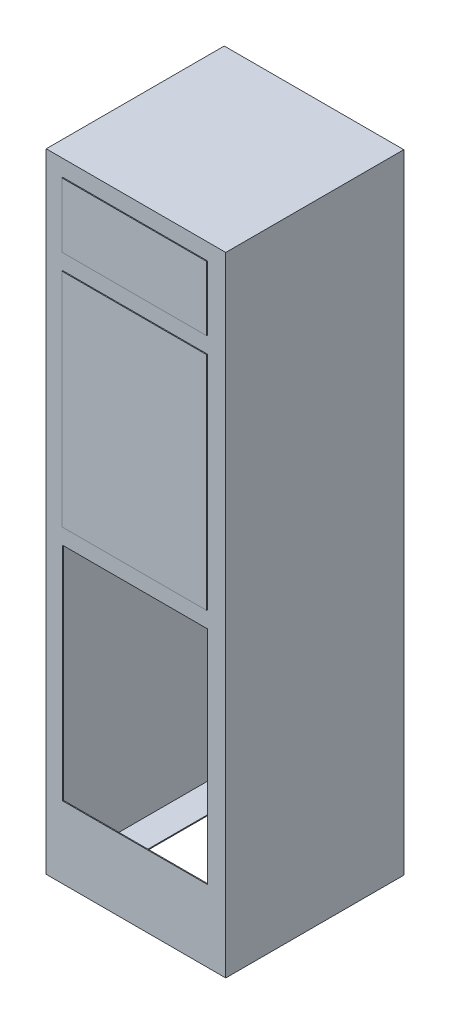
ISO-10303-21;
HEADER;
FILE_DESCRIPTION(('STEP AP214'),'2;1');
FILE_NAME('part.step','',(''),(''),'','','');
FILE_SCHEMA(('AUTOMOTIVE_DESIGN { 1 0 10303 214 1 1 1 1 }'));
ENDSEC;
DATA;
#1=APPLICATION_CONTEXT('core data for automotive mechanical design processes');
#2=APPLICATION_PROTOCOL_DEFINITION('international standard','automotive_design',2000,#1);
#3=PRODUCT_CONTEXT('',#1,'mechanical');
#4=PRODUCT('Part','Part','',(#3));
#5=PRODUCT_RELATED_PRODUCT_CATEGORY('part','',(#4));
#6=PRODUCT_DEFINITION_FORMATION('','',#4);
#7=PRODUCT_DEFINITION_CONTEXT('part definition',#1,'design');
#8=PRODUCT_DEFINITION('design','',#6,#7);
#9=PRODUCT_DEFINITION_SHAPE('','',#8);
#10=(LENGTH_UNIT() NAMED_UNIT(*) SI_UNIT(.MILLI.,.METRE.));
#11=(NAMED_UNIT(*) PLANE_ANGLE_UNIT() SI_UNIT($,.RADIAN.));
#12=(NAMED_UNIT(*) SI_UNIT($,.STERADIAN.) SOLID_ANGLE_UNIT());
#13=UNCERTAINTY_MEASURE_WITH_UNIT(LENGTH_MEASURE(1.E-05),#10,'distance_accuracy_value','');
#14=(GEOMETRIC_REPRESENTATION_CONTEXT(3) GLOBAL_UNCERTAINTY_ASSIGNED_CONTEXT((#13)) GLOBAL_UNIT_ASSIGNED_CONTEXT((#10,
#11,#12)) REPRESENTATION_CONTEXT('',''));
#15=CARTESIAN_POINT('',(0.,0.,0.));
#16=DIRECTION('',(0.,0.,1.));
#17=DIRECTION('',(1.,0.,0.));
#18=AXIS2_PLACEMENT_3D('',#15,#16,#17);
#19=CARTESIAN_POINT('',(-245.,780.,598.));
#20=DIRECTION('',(1.,0.,0.));
#21=DIRECTION('',(0.,0.,-1.));
#22=AXIS2_PLACEMENT_3D('',#19,#20,#21);
#23=PLANE('',#22);
#24=DIRECTION('',(0.,-1.,0.));
#25=VECTOR('',#24,1.);
#26=CARTESIAN_POINT('',(-245.,780.,595.));
#27=LINE('',#26,#25);
#28=CARTESIAN_POINT('',(-245.,995.,595.));
#29=VERTEX_POINT('',#28);
#30=CARTESIAN_POINT('',(-245.,780.,595.));
#31=VERTEX_POINT('',#30);
#32=EDGE_CURVE('E108',#29,#31,#27,.T.);
#33=ORIENTED_EDGE('',*,*,#32,.T.);
#34=DIRECTION('',(0.,0.,-1.));
#35=VECTOR('',#34,1.);
#36=CARTESIAN_POINT('',(-245.,780.,598.));
#37=LINE('',#36,#35);
#38=CARTESIAN_POINT('',(-245.,780.,598.));
#39=VERTEX_POINT('',#38);
#40=EDGE_CURVE('E12',#39,#31,#37,.T.);
#41=ORIENTED_EDGE('',*,*,#40,.F.);
#42=DIRECTION('',(0.,-1.,0.));
#43=VECTOR('',#42,1.);
#44=CARTESIAN_POINT('',(-245.,780.,598.));
#45=LINE('',#44,#43);
#46=CARTESIAN_POINT('',(-245.,995.,598.));
#47=VERTEX_POINT('',#46);
#48=EDGE_CURVE('E96',#47,#39,#45,.T.);
#49=ORIENTED_EDGE('',*,*,#48,.F.);
#50=DIRECTION('',(0.,0.,-1.));
#51=VECTOR('',#50,1.);
#52=CARTESIAN_POINT('',(-245.,995.,598.));
#53=LINE('',#52,#51);
#54=EDGE_CURVE('E104',#47,#29,#53,.T.);
#55=ORIENTED_EDGE('',*,*,#54,.T.);
#56=EDGE_LOOP('',(#33,#41,#49,#55));
#57=FACE_BOUND('',#56,.T.);
#58=ADVANCED_FACE('F45',(#57),#23,.F.);
#59=CARTESIAN_POINT('',(239.,780.,598.));
#60=DIRECTION('',(0.,1.,0.));
#61=DIRECTION('',(0.,0.,1.));
#62=AXIS2_PLACEMENT_3D('',#59,#60,#61);
#63=PLANE('',#62);
#64=DIRECTION('',(1.,0.,0.));
#65=VECTOR('',#64,1.);
#66=CARTESIAN_POINT('',(239.,780.,595.));
#67=LINE('',#66,#65);
#68=CARTESIAN_POINT('',(239.,780.,595.));
#69=VERTEX_POINT('',#68);
#70=EDGE_CURVE('E100',#31,#69,#67,.T.);
#71=ORIENTED_EDGE('',*,*,#70,.T.);
#72=DIRECTION('',(0.,0.,-1.));
#73=VECTOR('',#72,1.);
#74=CARTESIAN_POINT('',(239.,780.,598.));
#75=LINE('',#74,#73);
#76=CARTESIAN_POINT('',(239.,780.,598.));
#77=VERTEX_POINT('',#76);
#78=EDGE_CURVE('E53',#77,#69,#75,.T.);
#79=ORIENTED_EDGE('',*,*,#78,.F.);
#80=DIRECTION('',(1.,0.,0.));
#81=VECTOR('',#80,1.);
#82=CARTESIAN_POINT('',(239.,780.,598.));
#83=LINE('',#82,#81);
#84=EDGE_CURVE('E91',#39,#77,#83,.T.);
#85=ORIENTED_EDGE('',*,*,#84,.F.);
#86=ORIENTED_EDGE('',*,*,#40,.T.);
#87=EDGE_LOOP('',(#71,#79,#85,#86));
#88=FACE_BOUND('',#87,.T.);
#89=ADVANCED_FACE('F99',(#88),#63,.F.);
#90=CARTESIAN_POINT('',(239.,995.,598.));
#91=DIRECTION('',(-1.,0.,0.));
#92=DIRECTION('',(0.,-1.,0.));
#93=AXIS2_PLACEMENT_3D('',#90,#91,#92);
#94=PLANE('',#93);
#95=DIRECTION('',(0.,1.,0.));
#96=VECTOR('',#95,1.);
#97=CARTESIAN_POINT('',(239.,995.,595.));
#98=LINE('',#97,#96);
#99=CARTESIAN_POINT('',(239.,995.,595.));
#100=VERTEX_POINT('',#99);
#101=EDGE_CURVE('E78',#69,#100,#98,.T.);
#102=ORIENTED_EDGE('',*,*,#101,.T.);
#103=DIRECTION('',(0.,0.,-1.));
#104=VECTOR('',#103,1.);
#105=CARTESIAN_POINT('',(239.,995.,598.));
#106=LINE('',#105,#104);
#107=CARTESIAN_POINT('',(239.,995.,598.));
#108=VERTEX_POINT('',#107);
#109=EDGE_CURVE('E101',#108,#100,#106,.T.);
#110=ORIENTED_EDGE('',*,*,#109,.F.);
#111=DIRECTION('',(0.,1.,0.));
#112=VECTOR('',#111,1.);
#113=CARTESIAN_POINT('',(239.,995.,598.));
#114=LINE('',#113,#112);
#115=EDGE_CURVE('E94',#77,#108,#114,.T.);
#116=ORIENTED_EDGE('',*,*,#115,.F.);
#117=ORIENTED_EDGE('',*,*,#78,.T.);
#118=EDGE_LOOP('',(#102,#110,#116,#117));
#119=FACE_BOUND('',#118,.T.);
#120=ADVANCED_FACE('F102',(#119),#94,.F.);
#121=CARTESIAN_POINT('',(-245.,995.,598.));
#122=DIRECTION('',(0.,-1.,0.));
#123=DIRECTION('',(0.,0.,-1.));
#124=AXIS2_PLACEMENT_3D('',#121,#122,#123);
#125=PLANE('',#124);
#126=DIRECTION('',(-1.,0.,0.));
#127=VECTOR('',#126,1.);
#128=CARTESIAN_POINT('',(-245.,995.,595.));
#129=LINE('',#128,#127);
#130=EDGE_CURVE('E84',#100,#29,#129,.T.);
#131=ORIENTED_EDGE('',*,*,#130,.T.);
#132=ORIENTED_EDGE('',*,*,#54,.F.);
#133=DIRECTION('',(-1.,0.,0.));
#134=VECTOR('',#133,1.);
#135=CARTESIAN_POINT('',(-245.,995.,598.));
#136=LINE('',#135,#134);
#137=EDGE_CURVE('E61',#108,#47,#136,.T.);
#138=ORIENTED_EDGE('',*,*,#137,.F.);
#139=ORIENTED_EDGE('',*,*,#109,.T.);
#140=EDGE_LOOP('',(#131,#132,#138,#139));
#141=FACE_BOUND('',#140,.T.);
#142=ADVANCED_FACE('F115',(#141),#125,.F.);
#143=CARTESIAN_POINT('',(0.,0.,598.));
#144=DIRECTION('',(0.,0.,-1.));
#145=DIRECTION('',(-1.,0.,0.));
#146=AXIS2_PLACEMENT_3D('',#143,#144,#145);
#147=PLANE('',#146);
#148=ORIENTED_EDGE('',*,*,#48,.T.);
#149=ORIENTED_EDGE('',*,*,#84,.T.);
#150=ORIENTED_EDGE('',*,*,#115,.T.);
#151=ORIENTED_EDGE('',*,*,#137,.T.);
#152=EDGE_LOOP('',(#148,#149,#150,#151));
#153=FACE_BOUND('',#152,.T.);
#154=ADVANCED_FACE('F92',(#153),#147,.F.);
#155=CARTESIAN_POINT('',(0.,0.,595.));
#156=DIRECTION('',(0.,0.,-1.));
#157=DIRECTION('',(-1.,0.,0.));
#158=AXIS2_PLACEMENT_3D('',#155,#156,#157);
#159=PLANE('',#158);
#160=ORIENTED_EDGE('',*,*,#32,.F.);
#161=ORIENTED_EDGE('',*,*,#130,.F.);
#162=ORIENTED_EDGE('',*,*,#101,.F.);
#163=ORIENTED_EDGE('',*,*,#70,.F.);
#164=EDGE_LOOP('',(#160,#161,#162,#163));
#165=FACE_BOUND('',#164,.T.);
#166=ADVANCED_FACE('F118',(#165),#159,.T.);
#167=CLOSED_SHELL('',(#58,#89,#120,#142,#154,#166));
#168=MANIFOLD_SOLID_BREP('B2',#167);
#169=CARTESIAN_POINT('',(239.,-15.0000000000002,598.));
#170=DIRECTION('',(0.,1.,0.));
#171=DIRECTION('',(-1.,0.,0.));
#172=AXIS2_PLACEMENT_3D('',#169,#170,#171);
#173=PLANE('',#172);
#174=DIRECTION('',(1.,0.,0.));
#175=VECTOR('',#174,1.);
#176=CARTESIAN_POINT('',(239.,-15.0000000000002,595.));
#177=LINE('',#176,#175);
#178=CARTESIAN_POINT('',(-245.,-15.0000000000002,595.));
#179=VERTEX_POINT('',#178);
#180=CARTESIAN_POINT('',(239.,-15.0000000000002,595.));
#181=VERTEX_POINT('',#180);
#182=EDGE_CURVE('E244',#179,#181,#177,.T.);
#183=ORIENTED_EDGE('',*,*,#182,.T.);
#184=DIRECTION('',(0.,0.,-1.));
#185=VECTOR('',#184,1.);
#186=CARTESIAN_POINT('',(239.,-15.0000000000002,598.));
#187=LINE('',#186,#185);
#188=CARTESIAN_POINT('',(239.,-15.0000000000002,598.));
#189=VERTEX_POINT('',#188);
#190=EDGE_CURVE('E43',#189,#181,#187,.T.);
#191=ORIENTED_EDGE('',*,*,#190,.F.);
#192=DIRECTION('',(1.,0.,0.));
#193=VECTOR('',#192,1.);
#194=CARTESIAN_POINT('',(239.,-15.0000000000002,598.));
#195=LINE('',#194,#193);
#196=CARTESIAN_POINT('',(-245.,-15.0000000000002,598.));
#197=VERTEX_POINT('',#196);
#198=EDGE_CURVE('E232',#197,#189,#195,.T.);
#199=ORIENTED_EDGE('',*,*,#198,.F.);
#200=DIRECTION('',(0.,0.,-1.));
#201=VECTOR('',#200,1.);
#202=CARTESIAN_POINT('',(-245.,-15.0000000000002,598.));
#203=LINE('',#202,#201);
#204=EDGE_CURVE('E240',#197,#179,#203,.T.);
#205=ORIENTED_EDGE('',*,*,#204,.T.);
#206=EDGE_LOOP('',(#183,#191,#199,#205));
#207=FACE_BOUND('',#206,.T.);
#208=ADVANCED_FACE('F181',(#207),#173,.F.);
#209=CARTESIAN_POINT('',(239.,725.,598.));
#210=DIRECTION('',(-1.,0.,0.));
#211=DIRECTION('',(0.,0.,1.));
#212=AXIS2_PLACEMENT_3D('',#209,#210,#211);
#213=PLANE('',#212);
#214=DIRECTION('',(0.,1.,0.));
#215=VECTOR('',#214,1.);
#216=CARTESIAN_POINT('',(239.,725.,595.));
#217=LINE('',#216,#215);
#218=CARTESIAN_POINT('',(239.,725.,595.));
#219=VERTEX_POINT('',#218);
#220=EDGE_CURVE('E236',#181,#219,#217,.T.);
#221=ORIENTED_EDGE('',*,*,#220,.T.);
#222=DIRECTION('',(0.,0.,-1.));
#223=VECTOR('',#222,1.);
#224=CARTESIAN_POINT('',(239.,725.,598.));
#225=LINE('',#224,#223);
#226=CARTESIAN_POINT('',(239.,725.,598.));
#227=VERTEX_POINT('',#226);
#228=EDGE_CURVE('E189',#227,#219,#225,.T.);
#229=ORIENTED_EDGE('',*,*,#228,.F.);
#230=DIRECTION('',(0.,1.,0.));
#231=VECTOR('',#230,1.);
#232=CARTESIAN_POINT('',(239.,725.,598.));
#233=LINE('',#232,#231);
#234=EDGE_CURVE('E227',#189,#227,#233,.T.);
#235=ORIENTED_EDGE('',*,*,#234,.F.);
#236=ORIENTED_EDGE('',*,*,#190,.T.);
#237=EDGE_LOOP('',(#221,#229,#235,#236));
#238=FACE_BOUND('',#237,.T.);
#239=ADVANCED_FACE('F235',(#238),#213,.F.);
#240=CARTESIAN_POINT('',(-245.,725.,598.));
#241=DIRECTION('',(0.,-1.,0.));
#242=DIRECTION('',(0.,0.,-1.));
#243=AXIS2_PLACEMENT_3D('',#240,#241,#242);
#244=PLANE('',#243);
#245=DIRECTION('',(-1.,0.,0.));
#246=VECTOR('',#245,1.);
#247=CARTESIAN_POINT('',(-245.,725.,595.));
#248=LINE('',#247,#246);
#249=CARTESIAN_POINT('',(-245.,725.,595.));
#250=VERTEX_POINT('',#249);
#251=EDGE_CURVE('E214',#219,#250,#248,.T.);
#252=ORIENTED_EDGE('',*,*,#251,.T.);
#253=DIRECTION('',(0.,0.,-1.));
#254=VECTOR('',#253,1.);
#255=CARTESIAN_POINT('',(-245.,725.,598.));
#256=LINE('',#255,#254);
#257=CARTESIAN_POINT('',(-245.,725.,598.));
#258=VERTEX_POINT('',#257);
#259=EDGE_CURVE('E237',#258,#250,#256,.T.);
#260=ORIENTED_EDGE('',*,*,#259,.F.);
#261=DIRECTION('',(-1.,0.,0.));
#262=VECTOR('',#261,1.);
#263=CARTESIAN_POINT('',(-245.,725.,598.));
#264=LINE('',#263,#262);
#265=EDGE_CURVE('E230',#227,#258,#264,.T.);
#266=ORIENTED_EDGE('',*,*,#265,.F.);
#267=ORIENTED_EDGE('',*,*,#228,.T.);
#268=EDGE_LOOP('',(#252,#260,#266,#267));
#269=FACE_BOUND('',#268,.T.);
#270=ADVANCED_FACE('F238',(#269),#244,.F.);
#271=CARTESIAN_POINT('',(-245.,-15.0000000000002,598.));
#272=DIRECTION('',(1.,0.,0.));
#273=DIRECTION('',(0.,1.,0.));
#274=AXIS2_PLACEMENT_3D('',#271,#272,#273);
#275=PLANE('',#274);
#276=DIRECTION('',(0.,-1.,0.));
#277=VECTOR('',#276,1.);
#278=CARTESIAN_POINT('',(-245.,-15.0000000000002,595.));
#279=LINE('',#278,#277);
#280=EDGE_CURVE('E220',#250,#179,#279,.T.);
#281=ORIENTED_EDGE('',*,*,#280,.T.);
#282=ORIENTED_EDGE('',*,*,#204,.F.);
#283=DIRECTION('',(0.,-1.,0.));
#284=VECTOR('',#283,1.);
#285=CARTESIAN_POINT('',(-245.,-15.0000000000002,598.));
#286=LINE('',#285,#284);
#287=EDGE_CURVE('E197',#258,#197,#286,.T.);
#288=ORIENTED_EDGE('',*,*,#287,.F.);
#289=ORIENTED_EDGE('',*,*,#259,.T.);
#290=EDGE_LOOP('',(#281,#282,#288,#289));
#291=FACE_BOUND('',#290,.T.);
#292=ADVANCED_FACE('F251',(#291),#275,.F.);
#293=CARTESIAN_POINT('',(0.,0.,598.));
#294=DIRECTION('',(0.,0.,-1.));
#295=DIRECTION('',(-1.,0.,0.));
#296=AXIS2_PLACEMENT_3D('',#293,#294,#295);
#297=PLANE('',#296);
#298=ORIENTED_EDGE('',*,*,#198,.T.);
#299=ORIENTED_EDGE('',*,*,#234,.T.);
#300=ORIENTED_EDGE('',*,*,#265,.T.);
#301=ORIENTED_EDGE('',*,*,#287,.T.);
#302=EDGE_LOOP('',(#298,#299,#300,#301));
#303=FACE_BOUND('',#302,.T.);
#304=ADVANCED_FACE('F228',(#303),#297,.F.);
#305=CARTESIAN_POINT('',(0.,0.,595.));
#306=DIRECTION('',(0.,0.,-1.));
#307=DIRECTION('',(-1.,0.,0.));
#308=AXIS2_PLACEMENT_3D('',#305,#306,#307);
#309=PLANE('',#308);
#310=ORIENTED_EDGE('',*,*,#182,.F.);
#311=ORIENTED_EDGE('',*,*,#280,.F.);
#312=ORIENTED_EDGE('',*,*,#251,.F.);
#313=ORIENTED_EDGE('',*,*,#220,.F.);
#314=EDGE_LOOP('',(#310,#311,#312,#313));
#315=FACE_BOUND('',#314,.T.);
#316=ADVANCED_FACE('F254',(#315),#309,.T.);
#317=CLOSED_SHELL('',(#208,#239,#270,#292,#304,#316));
#318=MANIFOLD_SOLID_BREP('B6',#317);
#319=CARTESIAN_POINT('',(300.,-1050.,595.));
#320=DIRECTION('',(-1.,0.,0.));
#321=DIRECTION('',(0.,0.,1.));
#322=AXIS2_PLACEMENT_3D('',#319,#320,#321);
#323=PLANE('',#322);
#324=DIRECTION('',(0.,1.,0.));
#325=VECTOR('',#324,1.);
#326=CARTESIAN_POINT('',(300.,-1050.,0.));
#327=LINE('',#326,#325);
#328=CARTESIAN_POINT('',(300.,-1050.,0.));
#329=VERTEX_POINT('',#328);
#330=CARTESIAN_POINT('',(300.,1050.,0.));
#331=VERTEX_POINT('',#330);
#332=EDGE_CURVE('E625',#329,#331,#327,.T.);
#333=ORIENTED_EDGE('',*,*,#332,.T.);
#334=DIRECTION('',(0.,0.,-1.));
#335=VECTOR('',#334,1.);
#336=CARTESIAN_POINT('',(300.,1050.,595.));
#337=LINE('',#336,#335);
#338=CARTESIAN_POINT('',(300.,1050.,595.));
#339=VERTEX_POINT('',#338);
#340=EDGE_CURVE('E179',#339,#331,#337,.T.);
#341=ORIENTED_EDGE('',*,*,#340,.F.);
#342=DIRECTION('',(0.,1.,0.));
#343=VECTOR('',#342,1.);
#344=CARTESIAN_POINT('',(300.,-1050.,595.));
#345=LINE('',#344,#343);
#346=CARTESIAN_POINT('',(300.,-1050.,595.));
#347=VERTEX_POINT('',#346);
#348=EDGE_CURVE('E634',#347,#339,#345,.T.);
#349=ORIENTED_EDGE('',*,*,#348,.F.);
#350=DIRECTION('',(0.,0.,-1.));
#351=VECTOR('',#350,1.);
#352=CARTESIAN_POINT('',(300.,-1050.,595.));
#353=LINE('',#352,#351);
#354=EDGE_CURVE('E644',#347,#329,#353,.T.);
#355=ORIENTED_EDGE('',*,*,#354,.T.);
#356=EDGE_LOOP('',(#333,#341,#349,#355));
#357=FACE_BOUND('',#356,.T.);
#358=ADVANCED_FACE('F308',(#357),#323,.F.);
#359=CARTESIAN_POINT('',(-300.,1050.,595.));
#360=DIRECTION('',(0.,-1.,0.));
#361=DIRECTION('',(0.,0.,-1.));
#362=AXIS2_PLACEMENT_3D('',#359,#360,#361);
#363=PLANE('',#362);
#364=DIRECTION('',(-1.,0.,0.));
#365=VECTOR('',#364,1.);
#366=CARTESIAN_POINT('',(-300.,1050.,0.));
#367=LINE('',#366,#365);
#368=CARTESIAN_POINT('',(-300.,1050.,0.));
#369=VERTEX_POINT('',#368);
#370=EDGE_CURVE('E647',#331,#369,#367,.T.);
#371=ORIENTED_EDGE('',*,*,#370,.T.);
#372=DIRECTION('',(0.,0.,-1.));
#373=VECTOR('',#372,1.);
#374=CARTESIAN_POINT('',(-300.,1050.,595.));
#375=LINE('',#374,#373);
#376=CARTESIAN_POINT('',(-300.,1050.,595.));
#377=VERTEX_POINT('',#376);
#378=EDGE_CURVE('E315',#377,#369,#375,.T.);
#379=ORIENTED_EDGE('',*,*,#378,.F.);
#380=DIRECTION('',(-1.,0.,0.));
#381=VECTOR('',#380,1.);
#382=CARTESIAN_POINT('',(-300.,1050.,595.));
#383=LINE('',#382,#381);
#384=EDGE_CURVE('E637',#339,#377,#383,.T.);
#385=ORIENTED_EDGE('',*,*,#384,.F.);
#386=ORIENTED_EDGE('',*,*,#340,.T.);
#387=EDGE_LOOP('',(#371,#379,#385,#386));
#388=FACE_BOUND('',#387,.T.);
#389=ADVANCED_FACE('F678',(#388),#363,.F.);
#390=CARTESIAN_POINT('',(-300.,-1050.,595.));
#391=DIRECTION('',(1.,0.,0.));
#392=DIRECTION('',(0.,0.,-1.));
#393=AXIS2_PLACEMENT_3D('',#390,#391,#392);
#394=PLANE('',#393);
#395=DIRECTION('',(0.,-1.,0.));
#396=VECTOR('',#395,1.);
#397=CARTESIAN_POINT('',(-300.,-1050.,0.));
#398=LINE('',#397,#396);
#399=CARTESIAN_POINT('',(-300.,-1050.,0.));
#400=VERTEX_POINT('',#399);
#401=EDGE_CURVE('E649',#369,#400,#398,.T.);
#402=ORIENTED_EDGE('',*,*,#401,.T.);
#403=DIRECTION('',(0.,0.,-1.));
#404=VECTOR('',#403,1.);
#405=CARTESIAN_POINT('',(-300.,-1050.,595.));
#406=LINE('',#405,#404);
#407=CARTESIAN_POINT('',(-300.,-1050.,595.));
#408=VERTEX_POINT('',#407);
#409=EDGE_CURVE('E654',#408,#400,#406,.T.);
#410=ORIENTED_EDGE('',*,*,#409,.F.);
#411=DIRECTION('',(0.,-1.,0.));
#412=VECTOR('',#411,1.);
#413=CARTESIAN_POINT('',(-300.,-1050.,595.));
#414=LINE('',#413,#412);
#415=EDGE_CURVE('E640',#377,#408,#414,.T.);
#416=ORIENTED_EDGE('',*,*,#415,.F.);
#417=ORIENTED_EDGE('',*,*,#378,.T.);
#418=EDGE_LOOP('',(#402,#410,#416,#417));
#419=FACE_BOUND('',#418,.T.);
#420=ADVANCED_FACE('F661',(#419),#394,.F.);
#421=CARTESIAN_POINT('',(-300.,-1050.,595.));
#422=DIRECTION('',(0.,1.,0.));
#423=DIRECTION('',(0.,0.,1.));
#424=AXIS2_PLACEMENT_3D('',#421,#422,#423);
#425=PLANE('',#424);
#426=DIRECTION('',(-1.,0.,0.));
#427=VECTOR('',#426,1.);
#428=CARTESIAN_POINT('',(-200.,-1050.,495.));
#429=LINE('',#428,#427);
#430=CARTESIAN_POINT('',(200.,-1050.,495.));
#431=VERTEX_POINT('',#430);
#432=CARTESIAN_POINT('',(-200.,-1050.,495.));
#433=VERTEX_POINT('',#432);
#434=EDGE_CURVE('E582',#431,#433,#429,.T.);
#435=ORIENTED_EDGE('',*,*,#434,.F.);
#436=DIRECTION('',(0.,0.,1.));
#437=VECTOR('',#436,1.);
#438=CARTESIAN_POINT('',(200.,-1050.,495.));
#439=LINE('',#438,#437);
#440=CARTESIAN_POINT('',(200.,-1050.,100.));
#441=VERTEX_POINT('',#440);
#442=EDGE_CURVE('E565',#441,#431,#439,.T.);
#443=ORIENTED_EDGE('',*,*,#442,.F.);
#444=DIRECTION('',(1.,0.,0.));
#445=VECTOR('',#444,1.);
#446=CARTESIAN_POINT('',(-200.,-1050.,100.));
#447=LINE('',#446,#445);
#448=CARTESIAN_POINT('',(-200.,-1050.,100.));
#449=VERTEX_POINT('',#448);
#450=EDGE_CURVE('E571',#449,#441,#447,.T.);
#451=ORIENTED_EDGE('',*,*,#450,.F.);
#452=DIRECTION('',(0.,0.,-1.));
#453=VECTOR('',#452,1.);
#454=CARTESIAN_POINT('',(-200.,-1050.,495.));
#455=LINE('',#454,#453);
#456=EDGE_CURVE('E585',#433,#449,#455,.T.);
#457=ORIENTED_EDGE('',*,*,#456,.F.);
#458=EDGE_LOOP('',(#435,#443,#451,#457));
#459=FACE_BOUND('',#458,.T.);
#460=DIRECTION('',(1.,0.,0.));
#461=VECTOR('',#460,1.);
#462=CARTESIAN_POINT('',(-300.,-1050.,0.));
#463=LINE('',#462,#461);
#464=EDGE_CURVE('E638',#400,#329,#463,.T.);
#465=ORIENTED_EDGE('',*,*,#464,.T.);
#466=ORIENTED_EDGE('',*,*,#354,.F.);
#467=DIRECTION('',(1.,0.,0.));
#468=VECTOR('',#467,1.);
#469=CARTESIAN_POINT('',(-300.,-1050.,595.));
#470=LINE('',#469,#468);
#471=EDGE_CURVE('E642',#408,#347,#470,.T.);
#472=ORIENTED_EDGE('',*,*,#471,.F.);
#473=ORIENTED_EDGE('',*,*,#409,.T.);
#474=EDGE_LOOP('',(#465,#466,#472,#473));
#475=FACE_BOUND('',#474,.T.);
#476=ADVANCED_FACE('F670',(#459,#475),#425,.F.);
#477=CARTESIAN_POINT('',(0.,0.,595.));
#478=DIRECTION('',(0.,0.,-1.));
#479=DIRECTION('',(-1.,0.,0.));
#480=AXIS2_PLACEMENT_3D('',#477,#478,#479);
#481=PLANE('',#480);
#482=DIRECTION('',(0.,1.,0.));
#483=VECTOR('',#482,1.);
#484=CARTESIAN_POINT('',(-245.,-15.0000000000002,595.));
#485=LINE('',#484,#483);
#486=CARTESIAN_POINT('',(-245.,-15.0000000000002,595.));
#487=VERTEX_POINT('',#486);
#488=CARTESIAN_POINT('',(-245.,725.,595.));
#489=VERTEX_POINT('',#488);
#490=EDGE_CURVE('E525',#487,#489,#485,.T.);
#491=ORIENTED_EDGE('',*,*,#490,.T.);
#492=DIRECTION('',(1.,0.,0.));
#493=VECTOR('',#492,1.);
#494=CARTESIAN_POINT('',(297.,725.,595.));
#495=LINE('',#494,#493);
#496=CARTESIAN_POINT('',(239.,725.,595.));
#497=VERTEX_POINT('',#496);
#498=EDGE_CURVE('E509',#489,#497,#495,.T.);
#499=ORIENTED_EDGE('',*,*,#498,.T.);
#500=DIRECTION('',(0.,-1.,0.));
#501=VECTOR('',#500,1.);
#502=CARTESIAN_POINT('',(239.,-15.0000000000002,595.));
#503=LINE('',#502,#501);
#504=CARTESIAN_POINT('',(239.,-15.0000000000002,595.));
#505=VERTEX_POINT('',#504);
#506=EDGE_CURVE('E322',#497,#505,#503,.T.);
#507=ORIENTED_EDGE('',*,*,#506,.T.);
#508=DIRECTION('',(-1.,0.,0.));
#509=VECTOR('',#508,1.);
#510=CARTESIAN_POINT('',(-297.,-15.0000000000002,595.));
#511=LINE('',#510,#509);
#512=EDGE_CURVE('E543',#505,#487,#511,.T.);
#513=ORIENTED_EDGE('',*,*,#512,.T.);
#514=EDGE_LOOP('',(#491,#499,#507,#513));
#515=FACE_BOUND('',#514,.T.);
#516=DIRECTION('',(0.,1.,0.));
#517=VECTOR('',#516,1.);
#518=CARTESIAN_POINT('',(-245.,-70.0000000000002,595.));
#519=LINE('',#518,#517);
#520=CARTESIAN_POINT('',(-245.,-810.,595.));
#521=VERTEX_POINT('',#520);
#522=CARTESIAN_POINT('',(-245.,-70.0000000000002,595.));
#523=VERTEX_POINT('',#522);
#524=EDGE_CURVE('E555',#521,#523,#519,.T.);
#525=ORIENTED_EDGE('',*,*,#524,.T.);
#526=DIRECTION('',(1.,0.,0.));
#527=VECTOR('',#526,1.);
#528=CARTESIAN_POINT('',(297.,-70.0000000000002,595.));
#529=LINE('',#528,#527);
#530=CARTESIAN_POINT('',(239.,-70.0000000000002,595.));
#531=VERTEX_POINT('',#530);
#532=EDGE_CURVE('E537',#523,#531,#529,.T.);
#533=ORIENTED_EDGE('',*,*,#532,.T.);
#534=DIRECTION('',(0.,-1.,0.));
#535=VECTOR('',#534,1.);
#536=CARTESIAN_POINT('',(239.,-70.0000000000002,595.));
#537=LINE('',#536,#535);
#538=CARTESIAN_POINT('',(239.,-810.,595.));
#539=VERTEX_POINT('',#538);
#540=EDGE_CURVE('E545',#531,#539,#537,.T.);
#541=ORIENTED_EDGE('',*,*,#540,.T.);
#542=DIRECTION('',(-1.,0.,0.));
#543=VECTOR('',#542,1.);
#544=CARTESIAN_POINT('',(-297.,-810.,595.));
#545=LINE('',#544,#543);
#546=EDGE_CURVE('E592',#539,#521,#545,.T.);
#547=ORIENTED_EDGE('',*,*,#546,.T.);
#548=EDGE_LOOP('',(#525,#533,#541,#547));
#549=FACE_BOUND('',#548,.T.);
#550=ORIENTED_EDGE('',*,*,#348,.T.);
#551=ORIENTED_EDGE('',*,*,#384,.T.);
#552=ORIENTED_EDGE('',*,*,#415,.T.);
#553=ORIENTED_EDGE('',*,*,#471,.T.);
#554=EDGE_LOOP('',(#550,#551,#552,#553));
#555=FACE_BOUND('',#554,.T.);
#556=DIRECTION('',(0.,-1.,0.));
#557=VECTOR('',#556,1.);
#558=CARTESIAN_POINT('',(-245.,780.,595.));
#559=LINE('',#558,#557);
#560=CARTESIAN_POINT('',(-245.,995.,595.));
#561=VERTEX_POINT('',#560);
#562=CARTESIAN_POINT('',(-245.,780.,595.));
#563=VERTEX_POINT('',#562);
#564=EDGE_CURVE('E503',#561,#563,#559,.T.);
#565=ORIENTED_EDGE('',*,*,#564,.F.);
#566=DIRECTION('',(-1.,0.,0.));
#567=VECTOR('',#566,1.);
#568=CARTESIAN_POINT('',(-245.,995.,595.));
#569=LINE('',#568,#567);
#570=CARTESIAN_POINT('',(239.,995.,595.));
#571=VERTEX_POINT('',#570);
#572=EDGE_CURVE('E477',#571,#561,#569,.T.);
#573=ORIENTED_EDGE('',*,*,#572,.F.);
#574=DIRECTION('',(0.,1.,0.));
#575=VECTOR('',#574,1.);
#576=CARTESIAN_POINT('',(239.,780.,595.));
#577=LINE('',#576,#575);
#578=CARTESIAN_POINT('',(239.,780.,595.));
#579=VERTEX_POINT('',#578);
#580=EDGE_CURVE('E494',#579,#571,#577,.T.);
#581=ORIENTED_EDGE('',*,*,#580,.F.);
#582=DIRECTION('',(1.,0.,0.));
#583=VECTOR('',#582,1.);
#584=CARTESIAN_POINT('',(-245.,780.,595.));
#585=LINE('',#584,#583);
#586=EDGE_CURVE('E497',#563,#579,#585,.T.);
#587=ORIENTED_EDGE('',*,*,#586,.F.);
#588=EDGE_LOOP('',(#565,#573,#581,#587));
#589=FACE_BOUND('',#588,.T.);
#590=ADVANCED_FACE('F676',(#515,#549,#555,#589),#481,.F.);
#591=CARTESIAN_POINT('',(0.,0.,0.));
#592=DIRECTION('',(0.,0.,-1.));
#593=DIRECTION('',(-1.,0.,0.));
#594=AXIS2_PLACEMENT_3D('',#591,#592,#593);
#595=PLANE('',#594);
#596=ORIENTED_EDGE('',*,*,#332,.F.);
#597=ORIENTED_EDGE('',*,*,#464,.F.);
#598=ORIENTED_EDGE('',*,*,#401,.F.);
#599=ORIENTED_EDGE('',*,*,#370,.F.);
#600=EDGE_LOOP('',(#596,#597,#598,#599));
#601=FACE_BOUND('',#600,.T.);
#602=ADVANCED_FACE('F667',(#601),#595,.T.);
#603=CARTESIAN_POINT('',(297.,-1047.,3.));
#604=DIRECTION('',(1.,0.,0.));
#605=DIRECTION('',(0.,0.,-1.));
#606=AXIS2_PLACEMENT_3D('',#603,#604,#605);
#607=PLANE('',#606);
#608=DIRECTION('',(0.,1.,0.));
#609=VECTOR('',#608,1.);
#610=CARTESIAN_POINT('',(297.,-1047.,592.));
#611=LINE('',#610,#609);
#612=CARTESIAN_POINT('',(297.,-1047.,592.));
#613=VERTEX_POINT('',#612);
#614=CARTESIAN_POINT('',(297.,1047.,592.));
#615=VERTEX_POINT('',#614);
#616=EDGE_CURVE('E601',#613,#615,#611,.T.);
#617=ORIENTED_EDGE('',*,*,#616,.T.);
#618=DIRECTION('',(0.,0.,1.));
#619=VECTOR('',#618,1.);
#620=CARTESIAN_POINT('',(297.,1047.,3.));
#621=LINE('',#620,#619);
#622=CARTESIAN_POINT('',(297.,1047.,3.));
#623=VERTEX_POINT('',#622);
#624=EDGE_CURVE('E621',#623,#615,#621,.T.);
#625=ORIENTED_EDGE('',*,*,#624,.F.);
#626=DIRECTION('',(0.,1.,0.));
#627=VECTOR('',#626,1.);
#628=CARTESIAN_POINT('',(297.,-1047.,3.));
#629=LINE('',#628,#627);
#630=CARTESIAN_POINT('',(297.,-1047.,3.));
#631=VERTEX_POINT('',#630);
#632=EDGE_CURVE('E607',#631,#623,#629,.T.);
#633=ORIENTED_EDGE('',*,*,#632,.F.);
#634=DIRECTION('',(0.,0.,1.));
#635=VECTOR('',#634,1.);
#636=CARTESIAN_POINT('',(297.,-1047.,3.));
#637=LINE('',#636,#635);
#638=EDGE_CURVE('E622',#631,#613,#637,.T.);
#639=ORIENTED_EDGE('',*,*,#638,.T.);
#640=EDGE_LOOP('',(#617,#625,#633,#639));
#641=FACE_BOUND('',#640,.T.);
#642=ADVANCED_FACE('F691',(#641),#607,.F.);
#643=CARTESIAN_POINT('',(-297.,-1047.,3.));
#644=DIRECTION('',(0.,-1.,0.));
#645=DIRECTION('',(0.,0.,-1.));
#646=AXIS2_PLACEMENT_3D('',#643,#644,#645);
#647=PLANE('',#646);
#648=DIRECTION('',(1.,0.,0.));
#649=VECTOR('',#648,1.);
#650=CARTESIAN_POINT('',(-200.,-1047.,100.));
#651=LINE('',#650,#649);
#652=CARTESIAN_POINT('',(-200.,-1047.,100.));
#653=VERTEX_POINT('',#652);
#654=CARTESIAN_POINT('',(200.,-1047.,100.));
#655=VERTEX_POINT('',#654);
#656=EDGE_CURVE('E577',#653,#655,#651,.T.);
#657=ORIENTED_EDGE('',*,*,#656,.T.);
#658=DIRECTION('',(0.,0.,1.));
#659=VECTOR('',#658,1.);
#660=CARTESIAN_POINT('',(200.,-1047.,495.));
#661=LINE('',#660,#659);
#662=CARTESIAN_POINT('',(200.,-1047.,495.));
#663=VERTEX_POINT('',#662);
#664=EDGE_CURVE('E567',#655,#663,#661,.T.);
#665=ORIENTED_EDGE('',*,*,#664,.T.);
#666=DIRECTION('',(-1.,0.,0.));
#667=VECTOR('',#666,1.);
#668=CARTESIAN_POINT('',(-200.,-1047.,495.));
#669=LINE('',#668,#667);
#670=CARTESIAN_POINT('',(-200.,-1047.,495.));
#671=VERTEX_POINT('',#670);
#672=EDGE_CURVE('E570',#663,#671,#669,.T.);
#673=ORIENTED_EDGE('',*,*,#672,.T.);
#674=DIRECTION('',(0.,0.,-1.));
#675=VECTOR('',#674,1.);
#676=CARTESIAN_POINT('',(-200.,-1047.,495.));
#677=LINE('',#676,#675);
#678=EDGE_CURVE('E574',#671,#653,#677,.T.);
#679=ORIENTED_EDGE('',*,*,#678,.T.);
#680=EDGE_LOOP('',(#657,#665,#673,#679));
#681=FACE_BOUND('',#680,.T.);
#682=DIRECTION('',(0.,0.,1.));
#683=VECTOR('',#682,1.);
#684=CARTESIAN_POINT('',(-297.,-1047.,3.));
#685=LINE('',#684,#683);
#686=CARTESIAN_POINT('',(-297.,-1047.,3.));
#687=VERTEX_POINT('',#686);
#688=CARTESIAN_POINT('',(-297.,-1047.,592.));
#689=VERTEX_POINT('',#688);
#690=EDGE_CURVE('E626',#687,#689,#685,.T.);
#691=ORIENTED_EDGE('',*,*,#690,.T.);
#692=DIRECTION('',(1.,0.,0.));
#693=VECTOR('',#692,1.);
#694=CARTESIAN_POINT('',(297.,-1047.,592.));
#695=LINE('',#694,#693);
#696=EDGE_CURVE('E599',#689,#613,#695,.T.);
#697=ORIENTED_EDGE('',*,*,#696,.T.);
#698=ORIENTED_EDGE('',*,*,#638,.F.);
#699=DIRECTION('',(1.,0.,0.));
#700=VECTOR('',#699,1.);
#701=CARTESIAN_POINT('',(-297.,-1047.,3.));
#702=LINE('',#701,#700);
#703=EDGE_CURVE('E618',#687,#631,#702,.T.);
#704=ORIENTED_EDGE('',*,*,#703,.F.);
#705=EDGE_LOOP('',(#691,#697,#698,#704));
#706=FACE_BOUND('',#705,.T.);
#707=ADVANCED_FACE('F696',(#681,#706),#647,.F.);
#708=CARTESIAN_POINT('',(-297.,-1047.,3.));
#709=DIRECTION('',(-1.,0.,0.));
#710=DIRECTION('',(0.,0.,1.));
#711=AXIS2_PLACEMENT_3D('',#708,#709,#710);
#712=PLANE('',#711);
#713=DIRECTION('',(0.,0.,1.));
#714=VECTOR('',#713,1.);
#715=CARTESIAN_POINT('',(-297.,1047.,3.));
#716=LINE('',#715,#714);
#717=CARTESIAN_POINT('',(-297.,1047.,3.));
#718=VERTEX_POINT('',#717);
#719=CARTESIAN_POINT('',(-297.,1047.,592.));
#720=VERTEX_POINT('',#719);
#721=EDGE_CURVE('E629',#718,#720,#716,.T.);
#722=ORIENTED_EDGE('',*,*,#721,.T.);
#723=DIRECTION('',(0.,-1.,0.));
#724=VECTOR('',#723,1.);
#725=CARTESIAN_POINT('',(-297.,-1047.,592.));
#726=LINE('',#725,#724);
#727=EDGE_CURVE('E605',#720,#689,#726,.T.);
#728=ORIENTED_EDGE('',*,*,#727,.T.);
#729=ORIENTED_EDGE('',*,*,#690,.F.);
#730=DIRECTION('',(0.,-1.,0.));
#731=VECTOR('',#730,1.);
#732=CARTESIAN_POINT('',(-297.,-1047.,3.));
#733=LINE('',#732,#731);
#734=EDGE_CURVE('E615',#718,#687,#733,.T.);
#735=ORIENTED_EDGE('',*,*,#734,.F.);
#736=EDGE_LOOP('',(#722,#728,#729,#735));
#737=FACE_BOUND('',#736,.T.);
#738=ADVANCED_FACE('F702',(#737),#712,.F.);
#739=CARTESIAN_POINT('',(-297.,1047.,3.));
#740=DIRECTION('',(0.,1.,0.));
#741=DIRECTION('',(0.,0.,1.));
#742=AXIS2_PLACEMENT_3D('',#739,#740,#741);
#743=PLANE('',#742);
#744=ORIENTED_EDGE('',*,*,#624,.T.);
#745=DIRECTION('',(-1.,0.,0.));
#746=VECTOR('',#745,1.);
#747=CARTESIAN_POINT('',(-297.,1047.,592.));
#748=LINE('',#747,#746);
#749=EDGE_CURVE('E515',#615,#720,#748,.T.);
#750=ORIENTED_EDGE('',*,*,#749,.T.);
#751=ORIENTED_EDGE('',*,*,#721,.F.);
#752=DIRECTION('',(-1.,0.,0.));
#753=VECTOR('',#752,1.);
#754=CARTESIAN_POINT('',(-297.,1047.,3.));
#755=LINE('',#754,#753);
#756=EDGE_CURVE('E612',#623,#718,#755,.T.);
#757=ORIENTED_EDGE('',*,*,#756,.F.);
#758=EDGE_LOOP('',(#744,#750,#751,#757));
#759=FACE_BOUND('',#758,.T.);
#760=ADVANCED_FACE('F698',(#759),#743,.F.);
#761=CARTESIAN_POINT('',(0.,0.,3.));
#762=DIRECTION('',(0.,0.,-1.));
#763=DIRECTION('',(-1.,0.,0.));
#764=AXIS2_PLACEMENT_3D('',#761,#762,#763);
#765=PLANE('',#764);
#766=ORIENTED_EDGE('',*,*,#632,.T.);
#767=ORIENTED_EDGE('',*,*,#756,.T.);
#768=ORIENTED_EDGE('',*,*,#734,.T.);
#769=ORIENTED_EDGE('',*,*,#703,.T.);
#770=EDGE_LOOP('',(#766,#767,#768,#769));
#771=FACE_BOUND('',#770,.T.);
#772=ADVANCED_FACE('F701',(#771),#765,.F.);
#773=CARTESIAN_POINT('',(-297.,-810.,592.));
#774=DIRECTION('',(0.,1.,0.));
#775=DIRECTION('',(0.,0.,1.));
#776=AXIS2_PLACEMENT_3D('',#773,#774,#775);
#777=PLANE('',#776);
#778=DIRECTION('',(0.,0.,1.));
#779=VECTOR('',#778,1.);
#780=CARTESIAN_POINT('',(-245.,-810.,592.));
#781=LINE('',#780,#779);
#782=CARTESIAN_POINT('',(-245.,-810.,592.));
#783=VERTEX_POINT('',#782);
#784=EDGE_CURVE('E560',#783,#521,#781,.T.);
#785=ORIENTED_EDGE('',*,*,#784,.T.);
#786=ORIENTED_EDGE('',*,*,#546,.F.);
#787=DIRECTION('',(0.,0.,1.));
#788=VECTOR('',#787,1.);
#789=CARTESIAN_POINT('',(239.,-810.,592.));
#790=LINE('',#789,#788);
#791=CARTESIAN_POINT('',(239.,-810.,592.));
#792=VERTEX_POINT('',#791);
#793=EDGE_CURVE('E330',#792,#539,#790,.T.);
#794=ORIENTED_EDGE('',*,*,#793,.F.);
#795=DIRECTION('',(-1.,0.,0.));
#796=VECTOR('',#795,1.);
#797=CARTESIAN_POINT('',(-297.,-810.,592.));
#798=LINE('',#797,#796);
#799=EDGE_CURVE('E603',#792,#783,#798,.T.);
#800=ORIENTED_EDGE('',*,*,#799,.T.);
#801=EDGE_LOOP('',(#785,#786,#794,#800));
#802=FACE_BOUND('',#801,.T.);
#803=ADVANCED_FACE('F712',(#802),#777,.T.);
#804=CARTESIAN_POINT('',(0.,0.,592.));
#805=DIRECTION('',(0.,0.,-1.));
#806=DIRECTION('',(-1.,0.,0.));
#807=AXIS2_PLACEMENT_3D('',#804,#805,#806);
#808=PLANE('',#807);
#809=ORIENTED_EDGE('',*,*,#727,.F.);
#810=ORIENTED_EDGE('',*,*,#749,.F.);
#811=ORIENTED_EDGE('',*,*,#616,.F.);
#812=ORIENTED_EDGE('',*,*,#696,.F.);
#813=EDGE_LOOP('',(#809,#810,#811,#812));
#814=FACE_BOUND('',#813,.T.);
#815=DIRECTION('',(1.,0.,0.));
#816=VECTOR('',#815,1.);
#817=CARTESIAN_POINT('',(297.,725.,592.));
#818=LINE('',#817,#816);
#819=CARTESIAN_POINT('',(-245.,725.,592.));
#820=VERTEX_POINT('',#819);
#821=CARTESIAN_POINT('',(239.,725.,592.));
#822=VERTEX_POINT('',#821);
#823=EDGE_CURVE('E513',#820,#822,#818,.T.);
#824=ORIENTED_EDGE('',*,*,#823,.F.);
#825=DIRECTION('',(0.,1.,0.));
#826=VECTOR('',#825,1.);
#827=CARTESIAN_POINT('',(-245.,-15.0000000000002,592.));
#828=LINE('',#827,#826);
#829=CARTESIAN_POINT('',(-245.,-15.0000000000002,592.));
#830=VERTEX_POINT('',#829);
#831=EDGE_CURVE('E528',#830,#820,#828,.T.);
#832=ORIENTED_EDGE('',*,*,#831,.F.);
#833=DIRECTION('',(-1.,0.,0.));
#834=VECTOR('',#833,1.);
#835=CARTESIAN_POINT('',(-297.,-15.0000000000002,592.));
#836=LINE('',#835,#834);
#837=CARTESIAN_POINT('',(239.,-15.0000000000002,592.));
#838=VERTEX_POINT('',#837);
#839=EDGE_CURVE('E542',#838,#830,#836,.T.);
#840=ORIENTED_EDGE('',*,*,#839,.F.);
#841=DIRECTION('',(0.,-1.,0.));
#842=VECTOR('',#841,1.);
#843=CARTESIAN_POINT('',(239.,-15.0000000000002,592.));
#844=LINE('',#843,#842);
#845=EDGE_CURVE('E519',#822,#838,#844,.T.);
#846=ORIENTED_EDGE('',*,*,#845,.F.);
#847=EDGE_LOOP('',(#824,#832,#840,#846));
#848=FACE_BOUND('',#847,.T.);
#849=DIRECTION('',(1.,0.,0.));
#850=VECTOR('',#849,1.);
#851=CARTESIAN_POINT('',(297.,-70.0000000000002,592.));
#852=LINE('',#851,#850);
#853=CARTESIAN_POINT('',(-245.,-70.0000000000002,592.));
#854=VERTEX_POINT('',#853);
#855=CARTESIAN_POINT('',(239.,-70.0000000000002,592.));
#856=VERTEX_POINT('',#855);
#857=EDGE_CURVE('E540',#854,#856,#852,.T.);
#858=ORIENTED_EDGE('',*,*,#857,.F.);
#859=DIRECTION('',(0.,1.,0.));
#860=VECTOR('',#859,1.);
#861=CARTESIAN_POINT('',(-245.,-70.0000000000002,592.));
#862=LINE('',#861,#860);
#863=EDGE_CURVE('E557',#783,#854,#862,.T.);
#864=ORIENTED_EDGE('',*,*,#863,.F.);
#865=ORIENTED_EDGE('',*,*,#799,.F.);
#866=DIRECTION('',(0.,-1.,0.));
#867=VECTOR('',#866,1.);
#868=CARTESIAN_POINT('',(239.,-70.0000000000002,592.));
#869=LINE('',#868,#867);
#870=EDGE_CURVE('E549',#856,#792,#869,.T.);
#871=ORIENTED_EDGE('',*,*,#870,.F.);
#872=EDGE_LOOP('',(#858,#864,#865,#871));
#873=FACE_BOUND('',#872,.T.);
#874=DIRECTION('',(-1.,0.,0.));
#875=VECTOR('',#874,1.);
#876=CARTESIAN_POINT('',(-245.,995.,592.));
#877=LINE('',#876,#875);
#878=CARTESIAN_POINT('',(239.,995.,592.));
#879=VERTEX_POINT('',#878);
#880=CARTESIAN_POINT('',(-245.,995.,592.));
#881=VERTEX_POINT('',#880);
#882=EDGE_CURVE('E474',#879,#881,#877,.T.);
#883=ORIENTED_EDGE('',*,*,#882,.T.);
#884=DIRECTION('',(0.,-1.,0.));
#885=VECTOR('',#884,1.);
#886=CARTESIAN_POINT('',(-245.,780.,592.));
#887=LINE('',#886,#885);
#888=CARTESIAN_POINT('',(-245.,780.,592.));
#889=VERTEX_POINT('',#888);
#890=EDGE_CURVE('E486',#881,#889,#887,.T.);
#891=ORIENTED_EDGE('',*,*,#890,.T.);
#892=DIRECTION('',(1.,0.,0.));
#893=VECTOR('',#892,1.);
#894=CARTESIAN_POINT('',(-245.,780.,592.));
#895=LINE('',#894,#893);
#896=CARTESIAN_POINT('',(239.,780.,592.));
#897=VERTEX_POINT('',#896);
#898=EDGE_CURVE('E490',#889,#897,#895,.T.);
#899=ORIENTED_EDGE('',*,*,#898,.T.);
#900=DIRECTION('',(0.,1.,0.));
#901=VECTOR('',#900,1.);
#902=CARTESIAN_POINT('',(239.,780.,592.));
#903=LINE('',#902,#901);
#904=EDGE_CURVE('E482',#897,#879,#903,.T.);
#905=ORIENTED_EDGE('',*,*,#904,.T.);
#906=EDGE_LOOP('',(#883,#891,#899,#905));
#907=FACE_BOUND('',#906,.T.);
#908=ADVANCED_FACE('F492',(#814,#848,#873,#907),#808,.T.);
#909=CARTESIAN_POINT('',(200.,-1047.,495.));
#910=DIRECTION('',(1.,0.,0.));
#911=DIRECTION('',(0.,0.,-1.));
#912=AXIS2_PLACEMENT_3D('',#909,#910,#911);
#913=PLANE('',#912);
#914=ORIENTED_EDGE('',*,*,#442,.T.);
#915=DIRECTION('',(0.,-1.,0.));
#916=VECTOR('',#915,1.);
#917=CARTESIAN_POINT('',(200.,-1047.,495.));
#918=LINE('',#917,#916);
#919=EDGE_CURVE('E580',#663,#431,#918,.T.);
#920=ORIENTED_EDGE('',*,*,#919,.F.);
#921=ORIENTED_EDGE('',*,*,#664,.F.);
#922=DIRECTION('',(0.,-1.,0.));
#923=VECTOR('',#922,1.);
#924=CARTESIAN_POINT('',(200.,-1047.,100.));
#925=LINE('',#924,#923);
#926=EDGE_CURVE('E590',#655,#441,#925,.T.);
#927=ORIENTED_EDGE('',*,*,#926,.T.);
#928=EDGE_LOOP('',(#914,#920,#921,#927));
#929=FACE_BOUND('',#928,.T.);
#930=ADVANCED_FACE('F719',(#929),#913,.F.);
#931=CARTESIAN_POINT('',(-200.,-1047.,100.));
#932=DIRECTION('',(0.,0.,-1.));
#933=DIRECTION('',(-1.,0.,0.));
#934=AXIS2_PLACEMENT_3D('',#931,#932,#933);
#935=PLANE('',#934);
#936=ORIENTED_EDGE('',*,*,#450,.T.);
#937=ORIENTED_EDGE('',*,*,#926,.F.);
#938=ORIENTED_EDGE('',*,*,#656,.F.);
#939=DIRECTION('',(0.,-1.,0.));
#940=VECTOR('',#939,1.);
#941=CARTESIAN_POINT('',(-200.,-1047.,100.));
#942=LINE('',#941,#940);
#943=EDGE_CURVE('E593',#653,#449,#942,.T.);
#944=ORIENTED_EDGE('',*,*,#943,.T.);
#945=EDGE_LOOP('',(#936,#937,#938,#944));
#946=FACE_BOUND('',#945,.T.);
#947=ADVANCED_FACE('F723',(#946),#935,.F.);
#948=CARTESIAN_POINT('',(-200.,-1047.,495.));
#949=DIRECTION('',(-1.,0.,0.));
#950=DIRECTION('',(0.,0.,1.));
#951=AXIS2_PLACEMENT_3D('',#948,#949,#950);
#952=PLANE('',#951);
#953=ORIENTED_EDGE('',*,*,#456,.T.);
#954=ORIENTED_EDGE('',*,*,#943,.F.);
#955=ORIENTED_EDGE('',*,*,#678,.F.);
#956=DIRECTION('',(0.,-1.,0.));
#957=VECTOR('',#956,1.);
#958=CARTESIAN_POINT('',(-200.,-1047.,495.));
#959=LINE('',#958,#957);
#960=EDGE_CURVE('E595',#671,#433,#959,.T.);
#961=ORIENTED_EDGE('',*,*,#960,.T.);
#962=EDGE_LOOP('',(#953,#954,#955,#961));
#963=FACE_BOUND('',#962,.T.);
#964=ADVANCED_FACE('F729',(#963),#952,.F.);
#965=CARTESIAN_POINT('',(-200.,-1047.,495.));
#966=DIRECTION('',(0.,0.,1.));
#967=DIRECTION('',(1.,0.,0.));
#968=AXIS2_PLACEMENT_3D('',#965,#966,#967);
#969=PLANE('',#968);
#970=ORIENTED_EDGE('',*,*,#434,.T.);
#971=ORIENTED_EDGE('',*,*,#960,.F.);
#972=ORIENTED_EDGE('',*,*,#672,.F.);
#973=ORIENTED_EDGE('',*,*,#919,.T.);
#974=EDGE_LOOP('',(#970,#971,#972,#973));
#975=FACE_BOUND('',#974,.T.);
#976=ADVANCED_FACE('F725',(#975),#969,.F.);
#977=CARTESIAN_POINT('',(-245.,-70.0000000000002,592.));
#978=DIRECTION('',(1.,0.,0.));
#979=DIRECTION('',(0.,1.,0.));
#980=AXIS2_PLACEMENT_3D('',#977,#978,#979);
#981=PLANE('',#980);
#982=DIRECTION('',(0.,0.,1.));
#983=VECTOR('',#982,1.);
#984=CARTESIAN_POINT('',(-245.,-70.0000000000002,592.));
#985=LINE('',#984,#983);
#986=EDGE_CURVE('E563',#854,#523,#985,.T.);
#987=ORIENTED_EDGE('',*,*,#986,.T.);
#988=ORIENTED_EDGE('',*,*,#524,.F.);
#989=ORIENTED_EDGE('',*,*,#784,.F.);
#990=ORIENTED_EDGE('',*,*,#863,.T.);
#991=EDGE_LOOP('',(#987,#988,#989,#990));
#992=FACE_BOUND('',#991,.T.);
#993=ADVANCED_FACE('F728',(#992),#981,.T.);
#994=CARTESIAN_POINT('',(239.,-70.0000000000002,592.));
#995=DIRECTION('',(-1.,0.,0.));
#996=DIRECTION('',(0.,-1.,0.));
#997=AXIS2_PLACEMENT_3D('',#994,#995,#996);
#998=PLANE('',#997);
#999=ORIENTED_EDGE('',*,*,#793,.T.);
#1000=ORIENTED_EDGE('',*,*,#540,.F.);
#1001=DIRECTION('',(0.,0.,1.));
#1002=VECTOR('',#1001,1.);
#1003=CARTESIAN_POINT('',(239.,-70.0000000000002,592.));
#1004=LINE('',#1003,#1002);
#1005=EDGE_CURVE('E551',#856,#531,#1004,.T.);
#1006=ORIENTED_EDGE('',*,*,#1005,.F.);
#1007=ORIENTED_EDGE('',*,*,#870,.T.);
#1008=EDGE_LOOP('',(#999,#1000,#1006,#1007));
#1009=FACE_BOUND('',#1008,.T.);
#1010=ADVANCED_FACE('F739',(#1009),#998,.T.);
#1011=CARTESIAN_POINT('',(297.,-70.0000000000002,592.));
#1012=DIRECTION('',(0.,-1.,0.));
#1013=DIRECTION('',(0.,0.,-1.));
#1014=AXIS2_PLACEMENT_3D('',#1011,#1012,#1013);
#1015=PLANE('',#1014);
#1016=ORIENTED_EDGE('',*,*,#1005,.T.);
#1017=ORIENTED_EDGE('',*,*,#532,.F.);
#1018=ORIENTED_EDGE('',*,*,#986,.F.);
#1019=ORIENTED_EDGE('',*,*,#857,.T.);
#1020=EDGE_LOOP('',(#1016,#1017,#1018,#1019));
#1021=FACE_BOUND('',#1020,.T.);
#1022=ADVANCED_FACE('F743',(#1021),#1015,.T.);
#1023=CARTESIAN_POINT('',(-297.,-15.0000000000002,592.));
#1024=DIRECTION('',(0.,1.,0.));
#1025=DIRECTION('',(-1.,0.,0.));
#1026=AXIS2_PLACEMENT_3D('',#1023,#1024,#1025);
#1027=PLANE('',#1026);
#1028=DIRECTION('',(0.,0.,1.));
#1029=VECTOR('',#1028,1.);
#1030=CARTESIAN_POINT('',(239.,-15.0000000000002,592.));
#1031=LINE('',#1030,#1029);
#1032=EDGE_CURVE('E523',#838,#505,#1031,.T.);
#1033=ORIENTED_EDGE('',*,*,#1032,.F.);
#1034=ORIENTED_EDGE('',*,*,#839,.T.);
#1035=DIRECTION('',(0.,0.,1.));
#1036=VECTOR('',#1035,1.);
#1037=CARTESIAN_POINT('',(-245.,-15.0000000000002,592.));
#1038=LINE('',#1037,#1036);
#1039=EDGE_CURVE('E531',#830,#487,#1038,.T.);
#1040=ORIENTED_EDGE('',*,*,#1039,.T.);
#1041=ORIENTED_EDGE('',*,*,#512,.F.);
#1042=EDGE_LOOP('',(#1033,#1034,#1040,#1041));
#1043=FACE_BOUND('',#1042,.T.);
#1044=ADVANCED_FACE('F746',(#1043),#1027,.T.);
#1045=CARTESIAN_POINT('',(-245.,-15.0000000000002,592.));
#1046=DIRECTION('',(1.,0.,0.));
#1047=DIRECTION('',(0.,1.,0.));
#1048=AXIS2_PLACEMENT_3D('',#1045,#1046,#1047);
#1049=PLANE('',#1048);
#1050=ORIENTED_EDGE('',*,*,#490,.F.);
#1051=ORIENTED_EDGE('',*,*,#1039,.F.);
#1052=ORIENTED_EDGE('',*,*,#831,.T.);
#1053=DIRECTION('',(0.,0.,1.));
#1054=VECTOR('',#1053,1.);
#1055=CARTESIAN_POINT('',(-245.,725.,592.));
#1056=LINE('',#1055,#1054);
#1057=EDGE_CURVE('E534',#820,#489,#1056,.T.);
#1058=ORIENTED_EDGE('',*,*,#1057,.T.);
#1059=EDGE_LOOP('',(#1050,#1051,#1052,#1058));
#1060=FACE_BOUND('',#1059,.T.);
#1061=ADVANCED_FACE('F750',(#1060),#1049,.T.);
#1062=CARTESIAN_POINT('',(239.,-15.0000000000002,592.));
#1063=DIRECTION('',(-1.,0.,0.));
#1064=DIRECTION('',(0.,0.,1.));
#1065=AXIS2_PLACEMENT_3D('',#1062,#1063,#1064);
#1066=PLANE('',#1065);
#1067=ORIENTED_EDGE('',*,*,#506,.F.);
#1068=DIRECTION('',(0.,0.,1.));
#1069=VECTOR('',#1068,1.);
#1070=CARTESIAN_POINT('',(239.,725.,592.));
#1071=LINE('',#1070,#1069);
#1072=EDGE_CURVE('E521',#822,#497,#1071,.T.);
#1073=ORIENTED_EDGE('',*,*,#1072,.F.);
#1074=ORIENTED_EDGE('',*,*,#845,.T.);
#1075=ORIENTED_EDGE('',*,*,#1032,.T.);
#1076=EDGE_LOOP('',(#1067,#1073,#1074,#1075));
#1077=FACE_BOUND('',#1076,.T.);
#1078=ADVANCED_FACE('F754',(#1077),#1066,.T.);
#1079=CARTESIAN_POINT('',(297.,725.,592.));
#1080=DIRECTION('',(0.,-1.,0.));
#1081=DIRECTION('',(0.,0.,-1.));
#1082=AXIS2_PLACEMENT_3D('',#1079,#1080,#1081);
#1083=PLANE('',#1082);
#1084=ORIENTED_EDGE('',*,*,#498,.F.);
#1085=ORIENTED_EDGE('',*,*,#1057,.F.);
#1086=ORIENTED_EDGE('',*,*,#823,.T.);
#1087=ORIENTED_EDGE('',*,*,#1072,.T.);
#1088=EDGE_LOOP('',(#1084,#1085,#1086,#1087));
#1089=FACE_BOUND('',#1088,.T.);
#1090=ADVANCED_FACE('F758',(#1089),#1083,.T.);
#1091=CARTESIAN_POINT('',(-245.,995.,592.));
#1092=DIRECTION('',(0.,1.,0.));
#1093=DIRECTION('',(0.,0.,1.));
#1094=AXIS2_PLACEMENT_3D('',#1091,#1092,#1093);
#1095=PLANE('',#1094);
#1096=ORIENTED_EDGE('',*,*,#572,.T.);
#1097=DIRECTION('',(0.,0.,1.));
#1098=VECTOR('',#1097,1.);
#1099=CARTESIAN_POINT('',(-245.,995.,592.));
#1100=LINE('',#1099,#1098);
#1101=EDGE_CURVE('E470',#881,#561,#1100,.T.);
#1102=ORIENTED_EDGE('',*,*,#1101,.F.);
#1103=ORIENTED_EDGE('',*,*,#882,.F.);
#1104=DIRECTION('',(0.,0.,1.));
#1105=VECTOR('',#1104,1.);
#1106=CARTESIAN_POINT('',(239.,995.,592.));
#1107=LINE('',#1106,#1105);
#1108=EDGE_CURVE('E507',#879,#571,#1107,.T.);
#1109=ORIENTED_EDGE('',*,*,#1108,.T.);
#1110=EDGE_LOOP('',(#1096,#1102,#1103,#1109));
#1111=FACE_BOUND('',#1110,.T.);
#1112=ADVANCED_FACE('F472',(#1111),#1095,.F.);
#1113=CARTESIAN_POINT('',(239.,780.,592.));
#1114=DIRECTION('',(1.,0.,0.));
#1115=DIRECTION('',(0.,1.,0.));
#1116=AXIS2_PLACEMENT_3D('',#1113,#1114,#1115);
#1117=PLANE('',#1116);
#1118=ORIENTED_EDGE('',*,*,#580,.T.);
#1119=ORIENTED_EDGE('',*,*,#1108,.F.);
#1120=ORIENTED_EDGE('',*,*,#904,.F.);
#1121=DIRECTION('',(0.,0.,1.));
#1122=VECTOR('',#1121,1.);
#1123=CARTESIAN_POINT('',(239.,780.,592.));
#1124=LINE('',#1123,#1122);
#1125=EDGE_CURVE('E510',#897,#579,#1124,.T.);
#1126=ORIENTED_EDGE('',*,*,#1125,.T.);
#1127=EDGE_LOOP('',(#1118,#1119,#1120,#1126));
#1128=FACE_BOUND('',#1127,.T.);
#1129=ADVANCED_FACE('F765',(#1128),#1117,.F.);
#1130=CARTESIAN_POINT('',(-245.,780.,592.));
#1131=DIRECTION('',(0.,-1.,0.));
#1132=DIRECTION('',(0.,0.,-1.));
#1133=AXIS2_PLACEMENT_3D('',#1130,#1131,#1132);
#1134=PLANE('',#1133);
#1135=ORIENTED_EDGE('',*,*,#586,.T.);
#1136=ORIENTED_EDGE('',*,*,#1125,.F.);
#1137=ORIENTED_EDGE('',*,*,#898,.F.);
#1138=DIRECTION('',(0.,0.,1.));
#1139=VECTOR('',#1138,1.);
#1140=CARTESIAN_POINT('',(-245.,780.,592.));
#1141=LINE('',#1140,#1139);
#1142=EDGE_CURVE('E481',#889,#563,#1141,.T.);
#1143=ORIENTED_EDGE('',*,*,#1142,.T.);
#1144=EDGE_LOOP('',(#1135,#1136,#1137,#1143));
#1145=FACE_BOUND('',#1144,.T.);
#1146=ADVANCED_FACE('F768',(#1145),#1134,.F.);
#1147=CARTESIAN_POINT('',(-245.,780.,592.));
#1148=DIRECTION('',(-1.,0.,0.));
#1149=DIRECTION('',(0.,0.,1.));
#1150=AXIS2_PLACEMENT_3D('',#1147,#1148,#1149);
#1151=PLANE('',#1150);
#1152=ORIENTED_EDGE('',*,*,#564,.T.);
#1153=ORIENTED_EDGE('',*,*,#1142,.F.);
#1154=ORIENTED_EDGE('',*,*,#890,.F.);
#1155=ORIENTED_EDGE('',*,*,#1101,.T.);
#1156=EDGE_LOOP('',(#1152,#1153,#1154,#1155));
#1157=FACE_BOUND('',#1156,.T.);
#1158=ADVANCED_FACE('F487',(#1157),#1151,.F.);
#1159=CLOSED_SHELL('',(#358,#389,#420,#476,#590,#602,#642,#707,#738,#760,#772,#803,#908,#930,
#947,#964,#976,#993,#1010,#1022,#1044,#1061,#1078,#1090,#1112,#1129,#1146,#1158));
#1160=MANIFOLD_SOLID_BREP('B37',#1159);
#1161=ADVANCED_BREP_SHAPE_REPRESENTATION('',(#18,#168,#318,#1160),#14);
#1162=SHAPE_DEFINITION_REPRESENTATION(#9,#1161);
ENDSEC;
END-ISO-10303-21;
